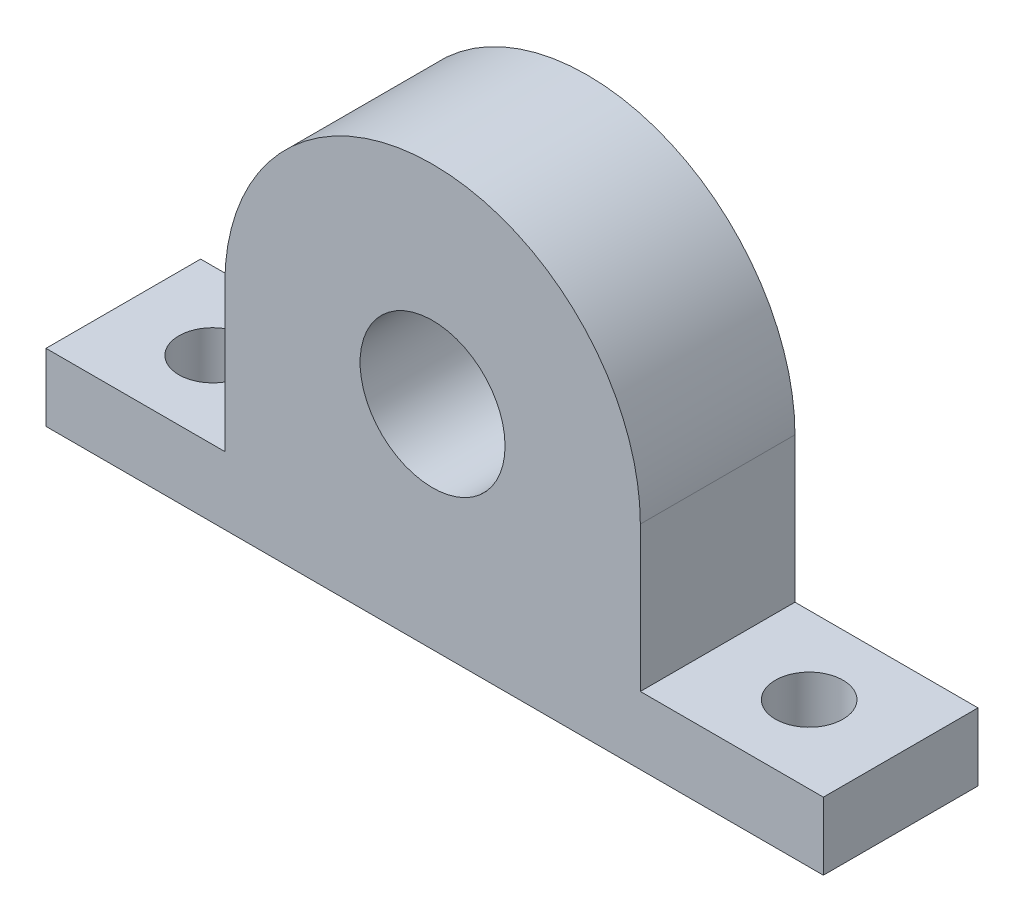
ISO-10303-21;
HEADER;
FILE_DESCRIPTION(('STEP AP214'),'2;1');
FILE_NAME('part.step','',(''),(''),'','','');
FILE_SCHEMA(('AUTOMOTIVE_DESIGN { 1 0 10303 214 1 1 1 1 }'));
ENDSEC;
DATA;
#1=APPLICATION_CONTEXT('core data for automotive mechanical design processes');
#2=APPLICATION_PROTOCOL_DEFINITION('international standard','automotive_design',2000,#1);
#3=PRODUCT_CONTEXT('',#1,'mechanical');
#4=PRODUCT('Part','Part','',(#3));
#5=PRODUCT_RELATED_PRODUCT_CATEGORY('part','',(#4));
#6=PRODUCT_DEFINITION_FORMATION('','',#4);
#7=PRODUCT_DEFINITION_CONTEXT('part definition',#1,'design');
#8=PRODUCT_DEFINITION('design','',#6,#7);
#9=PRODUCT_DEFINITION_SHAPE('','',#8);
#10=(LENGTH_UNIT() NAMED_UNIT(*) SI_UNIT(.MILLI.,.METRE.));
#11=(NAMED_UNIT(*) PLANE_ANGLE_UNIT() SI_UNIT($,.RADIAN.));
#12=(NAMED_UNIT(*) SI_UNIT($,.STERADIAN.) SOLID_ANGLE_UNIT());
#13=UNCERTAINTY_MEASURE_WITH_UNIT(LENGTH_MEASURE(1.E-05),#10,'distance_accuracy_value','');
#14=(GEOMETRIC_REPRESENTATION_CONTEXT(3) GLOBAL_UNCERTAINTY_ASSIGNED_CONTEXT((#13)) GLOBAL_UNIT_ASSIGNED_CONTEXT((#10,
#11,#12)) REPRESENTATION_CONTEXT('',''));
#15=CARTESIAN_POINT('',(0.,0.,0.));
#16=DIRECTION('',(0.,0.,1.));
#17=DIRECTION('',(1.,0.,0.));
#18=AXIS2_PLACEMENT_3D('',#15,#16,#17);
#19=CARTESIAN_POINT('',(21.5,0.,16.));
#20=DIRECTION('',(1.,0.,0.));
#21=DIRECTION('',(0.,0.,-1.));
#22=AXIS2_PLACEMENT_3D('',#19,#20,#21);
#23=PLANE('',#22);
#24=DIRECTION('',(0.,-1.,0.));
#25=VECTOR('',#24,1.);
#26=CARTESIAN_POINT('',(21.5,0.,0.));
#27=LINE('',#26,#25);
#28=CARTESIAN_POINT('',(21.5,0.,0.));
#29=VERTEX_POINT('',#28);
#30=CARTESIAN_POINT('',(21.5,-15.,0.));
#31=VERTEX_POINT('',#30);
#32=EDGE_CURVE('E147',#29,#31,#27,.T.);
#33=ORIENTED_EDGE('',*,*,#32,.F.);
#34=DIRECTION('',(0.,0.,-1.));
#35=VECTOR('',#34,1.);
#36=CARTESIAN_POINT('',(21.5,0.,16.));
#37=LINE('',#36,#35);
#38=CARTESIAN_POINT('',(21.5,0.,16.));
#39=VERTEX_POINT('',#38);
#40=EDGE_CURVE('E11',#39,#29,#37,.T.);
#41=ORIENTED_EDGE('',*,*,#40,.F.);
#42=DIRECTION('',(0.,-1.,0.));
#43=VECTOR('',#42,1.);
#44=CARTESIAN_POINT('',(21.5,0.,16.));
#45=LINE('',#44,#43);
#46=CARTESIAN_POINT('',(21.5,-15.,16.));
#47=VERTEX_POINT('',#46);
#48=EDGE_CURVE('E175',#39,#47,#45,.T.);
#49=ORIENTED_EDGE('',*,*,#48,.T.);
#50=DIRECTION('',(0.,0.,-1.));
#51=VECTOR('',#50,1.);
#52=CARTESIAN_POINT('',(21.5,-15.,16.));
#53=LINE('',#52,#51);
#54=EDGE_CURVE('E59',#47,#31,#53,.T.);
#55=ORIENTED_EDGE('',*,*,#54,.T.);
#56=EDGE_LOOP('',(#33,#41,#49,#55));
#57=FACE_BOUND('',#56,.T.);
#58=ADVANCED_FACE('F41',(#57),#23,.T.);
#59=CARTESIAN_POINT('',(0.,0.,16.));
#60=DIRECTION('',(0.,0.,-1.));
#61=DIRECTION('',(-1.,0.,0.));
#62=AXIS2_PLACEMENT_3D('',#59,#60,#61);
#63=CYLINDRICAL_SURFACE('',#62,21.5);
#64=CARTESIAN_POINT('',(0.,0.,0.));
#65=DIRECTION('',(0.,0.,1.));
#66=DIRECTION('',(1.,0.,0.));
#67=AXIS2_PLACEMENT_3D('',#64,#65,#66);
#68=CIRCLE('',#67,21.5);
#69=CARTESIAN_POINT('',(-21.5,0.,0.));
#70=VERTEX_POINT('',#69);
#71=EDGE_CURVE('E150',#29,#70,#68,.T.);
#72=ORIENTED_EDGE('',*,*,#71,.T.);
#73=DIRECTION('',(0.,0.,-1.));
#74=VECTOR('',#73,1.);
#75=CARTESIAN_POINT('',(-21.5,0.,16.));
#76=LINE('',#75,#74);
#77=CARTESIAN_POINT('',(-21.5,0.,16.));
#78=VERTEX_POINT('',#77);
#79=EDGE_CURVE('E51',#78,#70,#76,.T.);
#80=ORIENTED_EDGE('',*,*,#79,.F.);
#81=CARTESIAN_POINT('',(0.,0.,16.));
#82=DIRECTION('',(0.,0.,1.));
#83=DIRECTION('',(1.,0.,0.));
#84=AXIS2_PLACEMENT_3D('',#81,#82,#83);
#85=CIRCLE('',#84,21.5);
#86=EDGE_CURVE('E209',#39,#78,#85,.T.);
#87=ORIENTED_EDGE('',*,*,#86,.F.);
#88=ORIENTED_EDGE('',*,*,#40,.T.);
#89=EDGE_LOOP('',(#72,#80,#87,#88));
#90=FACE_BOUND('',#89,.T.);
#91=ADVANCED_FACE('F242',(#90),#63,.T.);
#92=CARTESIAN_POINT('',(-21.5,0.,16.));
#93=DIRECTION('',(1.,0.,0.));
#94=DIRECTION('',(0.,0.,-1.));
#95=AXIS2_PLACEMENT_3D('',#92,#93,#94);
#96=PLANE('',#95);
#97=DIRECTION('',(0.,-1.,0.));
#98=VECTOR('',#97,1.);
#99=CARTESIAN_POINT('',(-21.5,0.,0.));
#100=LINE('',#99,#98);
#101=CARTESIAN_POINT('',(-21.5,-15.,0.));
#102=VERTEX_POINT('',#101);
#103=EDGE_CURVE('E153',#70,#102,#100,.T.);
#104=ORIENTED_EDGE('',*,*,#103,.T.);
#105=DIRECTION('',(0.,0.,-1.));
#106=VECTOR('',#105,1.);
#107=CARTESIAN_POINT('',(-21.5,-15.,16.));
#108=LINE('',#107,#106);
#109=CARTESIAN_POINT('',(-21.5,-15.,16.));
#110=VERTEX_POINT('',#109);
#111=EDGE_CURVE('E185',#110,#102,#108,.T.);
#112=ORIENTED_EDGE('',*,*,#111,.F.);
#113=DIRECTION('',(0.,-1.,0.));
#114=VECTOR('',#113,1.);
#115=CARTESIAN_POINT('',(-21.5,0.,16.));
#116=LINE('',#115,#114);
#117=EDGE_CURVE('E196',#78,#110,#116,.T.);
#118=ORIENTED_EDGE('',*,*,#117,.F.);
#119=ORIENTED_EDGE('',*,*,#79,.T.);
#120=EDGE_LOOP('',(#104,#112,#118,#119));
#121=FACE_BOUND('',#120,.T.);
#122=ADVANCED_FACE('F194',(#121),#96,.F.);
#123=CARTESIAN_POINT('',(0.,-15.,16.));
#124=DIRECTION('',(0.,1.,0.));
#125=DIRECTION('',(0.,0.,1.));
#126=AXIS2_PLACEMENT_3D('',#123,#124,#125);
#127=PLANE('',#126);
#128=CARTESIAN_POINT('',(-30.75,-15.,8.));
#129=DIRECTION('',(0.,1.,0.));
#130=DIRECTION('',(0.,0.,1.));
#131=AXIS2_PLACEMENT_3D('',#128,#129,#130);
#132=CIRCLE('',#131,3.5);
#133=CARTESIAN_POINT('',(-30.75,-15.,11.5));
#134=VERTEX_POINT('',#133);
#135=EDGE_CURVE('E222',#134,#134,#132,.T.);
#136=ORIENTED_EDGE('',*,*,#135,.F.);
#137=EDGE_LOOP('',(#136));
#138=FACE_BOUND('',#137,.T.);
#139=DIRECTION('',(1.,0.,0.));
#140=VECTOR('',#139,1.);
#141=CARTESIAN_POINT('',(0.,-15.,0.));
#142=LINE('',#141,#140);
#143=CARTESIAN_POINT('',(-40.,-15.,0.));
#144=VERTEX_POINT('',#143);
#145=EDGE_CURVE('E157',#144,#102,#142,.T.);
#146=ORIENTED_EDGE('',*,*,#145,.F.);
#147=DIRECTION('',(0.,0.,-1.));
#148=VECTOR('',#147,1.);
#149=CARTESIAN_POINT('',(-40.,-15.,16.));
#150=LINE('',#149,#148);
#151=CARTESIAN_POINT('',(-40.,-15.,16.));
#152=VERTEX_POINT('',#151);
#153=EDGE_CURVE('E182',#152,#144,#150,.T.);
#154=ORIENTED_EDGE('',*,*,#153,.F.);
#155=DIRECTION('',(1.,0.,0.));
#156=VECTOR('',#155,1.);
#157=CARTESIAN_POINT('',(0.,-15.,16.));
#158=LINE('',#157,#156);
#159=EDGE_CURVE('E139',#152,#110,#158,.T.);
#160=ORIENTED_EDGE('',*,*,#159,.T.);
#161=ORIENTED_EDGE('',*,*,#111,.T.);
#162=EDGE_LOOP('',(#146,#154,#160,#161));
#163=FACE_BOUND('',#162,.T.);
#164=ADVANCED_FACE('F205',(#138,#163),#127,.T.);
#165=CARTESIAN_POINT('',(-40.,0.,16.));
#166=DIRECTION('',(-1.,0.,0.));
#167=DIRECTION('',(0.,0.,1.));
#168=AXIS2_PLACEMENT_3D('',#165,#166,#167);
#169=PLANE('',#168);
#170=DIRECTION('',(0.,1.,0.));
#171=VECTOR('',#170,1.);
#172=CARTESIAN_POINT('',(-40.,0.,0.));
#173=LINE('',#172,#171);
#174=CARTESIAN_POINT('',(-40.,-22.,0.));
#175=VERTEX_POINT('',#174);
#176=EDGE_CURVE('E161',#175,#144,#173,.T.);
#177=ORIENTED_EDGE('',*,*,#176,.F.);
#178=DIRECTION('',(0.,0.,-1.));
#179=VECTOR('',#178,1.);
#180=CARTESIAN_POINT('',(-40.,-22.,16.));
#181=LINE('',#180,#179);
#182=CARTESIAN_POINT('',(-40.,-22.,16.));
#183=VERTEX_POINT('',#182);
#184=EDGE_CURVE('E120',#183,#175,#181,.T.);
#185=ORIENTED_EDGE('',*,*,#184,.F.);
#186=DIRECTION('',(0.,1.,0.));
#187=VECTOR('',#186,1.);
#188=CARTESIAN_POINT('',(-40.,0.,16.));
#189=LINE('',#188,#187);
#190=EDGE_CURVE('E135',#183,#152,#189,.T.);
#191=ORIENTED_EDGE('',*,*,#190,.T.);
#192=ORIENTED_EDGE('',*,*,#153,.T.);
#193=EDGE_LOOP('',(#177,#185,#191,#192));
#194=FACE_BOUND('',#193,.T.);
#195=ADVANCED_FACE('F234',(#194),#169,.T.);
#196=CARTESIAN_POINT('',(0.,-22.,16.));
#197=DIRECTION('',(0.,-1.,0.));
#198=DIRECTION('',(0.,0.,-1.));
#199=AXIS2_PLACEMENT_3D('',#196,#197,#198);
#200=PLANE('',#199);
#201=CARTESIAN_POINT('',(-30.75,-22.,8.));
#202=DIRECTION('',(0.,-1.,0.));
#203=DIRECTION('',(0.,0.,-1.));
#204=AXIS2_PLACEMENT_3D('',#201,#202,#203);
#205=CIRCLE('',#204,3.5);
#206=CARTESIAN_POINT('',(-30.75,-22.,4.5));
#207=VERTEX_POINT('',#206);
#208=EDGE_CURVE('E44',#207,#207,#205,.T.);
#209=ORIENTED_EDGE('',*,*,#208,.F.);
#210=EDGE_LOOP('',(#209));
#211=FACE_BOUND('',#210,.T.);
#212=CARTESIAN_POINT('',(30.9699700372951,-22.,8.));
#213=DIRECTION('',(0.,-1.,0.));
#214=DIRECTION('',(0.,0.,-1.));
#215=AXIS2_PLACEMENT_3D('',#212,#213,#214);
#216=CIRCLE('',#215,3.5);
#217=CARTESIAN_POINT('',(30.9699700372951,-22.,4.5));
#218=VERTEX_POINT('',#217);
#219=EDGE_CURVE('E218',#218,#218,#216,.T.);
#220=ORIENTED_EDGE('',*,*,#219,.F.);
#221=EDGE_LOOP('',(#220));
#222=FACE_BOUND('',#221,.T.);
#223=DIRECTION('',(-1.,0.,0.));
#224=VECTOR('',#223,1.);
#225=CARTESIAN_POINT('',(0.,-22.,0.));
#226=LINE('',#225,#224);
#227=CARTESIAN_POINT('',(40.4399400745901,-22.,0.));
#228=VERTEX_POINT('',#227);
#229=EDGE_CURVE('E116',#228,#175,#226,.T.);
#230=ORIENTED_EDGE('',*,*,#229,.F.);
#231=DIRECTION('',(0.,0.,-1.));
#232=VECTOR('',#231,1.);
#233=CARTESIAN_POINT('',(40.4399400745901,-22.,16.));
#234=LINE('',#233,#232);
#235=CARTESIAN_POINT('',(40.4399400745901,-22.,16.));
#236=VERTEX_POINT('',#235);
#237=EDGE_CURVE('E110',#236,#228,#234,.T.);
#238=ORIENTED_EDGE('',*,*,#237,.F.);
#239=DIRECTION('',(-1.,0.,0.));
#240=VECTOR('',#239,1.);
#241=CARTESIAN_POINT('',(0.,-22.,16.));
#242=LINE('',#241,#240);
#243=EDGE_CURVE('E114',#236,#183,#242,.T.);
#244=ORIENTED_EDGE('',*,*,#243,.T.);
#245=ORIENTED_EDGE('',*,*,#184,.T.);
#246=EDGE_LOOP('',(#230,#238,#244,#245));
#247=FACE_BOUND('',#246,.T.);
#248=ADVANCED_FACE('F112',(#211,#222,#247),#200,.T.);
#249=CARTESIAN_POINT('',(40.4399400745901,0.,16.));
#250=DIRECTION('',(-1.,0.,0.));
#251=DIRECTION('',(0.,-1.,0.));
#252=AXIS2_PLACEMENT_3D('',#249,#250,#251);
#253=PLANE('',#252);
#254=DIRECTION('',(0.,1.,0.));
#255=VECTOR('',#254,1.);
#256=CARTESIAN_POINT('',(40.4399400745901,0.,0.));
#257=LINE('',#256,#255);
#258=CARTESIAN_POINT('',(40.4399400745901,-15.,0.));
#259=VERTEX_POINT('',#258);
#260=EDGE_CURVE('E168',#228,#259,#257,.T.);
#261=ORIENTED_EDGE('',*,*,#260,.T.);
#262=DIRECTION('',(0.,0.,-1.));
#263=VECTOR('',#262,1.);
#264=CARTESIAN_POINT('',(40.4399400745901,-15.,16.));
#265=LINE('',#264,#263);
#266=CARTESIAN_POINT('',(40.4399400745901,-15.,16.));
#267=VERTEX_POINT('',#266);
#268=EDGE_CURVE('E85',#267,#259,#265,.T.);
#269=ORIENTED_EDGE('',*,*,#268,.F.);
#270=DIRECTION('',(0.,1.,0.));
#271=VECTOR('',#270,1.);
#272=CARTESIAN_POINT('',(40.4399400745901,0.,16.));
#273=LINE('',#272,#271);
#274=EDGE_CURVE('E122',#236,#267,#273,.T.);
#275=ORIENTED_EDGE('',*,*,#274,.F.);
#276=ORIENTED_EDGE('',*,*,#237,.T.);
#277=EDGE_LOOP('',(#261,#269,#275,#276));
#278=FACE_BOUND('',#277,.T.);
#279=ADVANCED_FACE('F123',(#278),#253,.F.);
#280=CARTESIAN_POINT('',(30.9699700372951,-15.,8.));
#281=DIRECTION('',(0.,1.,0.));
#282=DIRECTION('',(0.,0.,1.));
#283=AXIS2_PLACEMENT_3D('',#280,#281,#282);
#284=CIRCLE('',#283,3.5);
#285=CARTESIAN_POINT('',(30.9699700372951,-15.,11.5));
#286=VERTEX_POINT('',#285);
#287=EDGE_CURVE('E223',#286,#286,#284,.T.);
#288=ORIENTED_EDGE('',*,*,#287,.F.);
#289=EDGE_LOOP('',(#288));
#290=FACE_BOUND('',#289,.T.);
#291=EDGE_CURVE('E162',#31,#259,#142,.T.);
#292=ORIENTED_EDGE('',*,*,#291,.F.);
#293=ORIENTED_EDGE('',*,*,#54,.F.);
#294=EDGE_CURVE('E127',#47,#267,#158,.T.);
#295=ORIENTED_EDGE('',*,*,#294,.T.);
#296=ORIENTED_EDGE('',*,*,#268,.T.);
#297=EDGE_LOOP('',(#292,#293,#295,#296));
#298=FACE_BOUND('',#297,.T.);
#299=ADVANCED_FACE('F212',(#290,#298),#127,.T.);
#300=CARTESIAN_POINT('',(0.,0.,16.));
#301=DIRECTION('',(0.,0.,-1.));
#302=DIRECTION('',(-1.,0.,0.));
#303=AXIS2_PLACEMENT_3D('',#300,#301,#302);
#304=CYLINDRICAL_SURFACE('',#303,7.5);
#305=CARTESIAN_POINT('',(0.,0.,16.));
#306=DIRECTION('',(0.,0.,1.));
#307=DIRECTION('',(1.,0.,0.));
#308=AXIS2_PLACEMENT_3D('',#305,#306,#307);
#309=CIRCLE('',#308,7.5);
#310=CARTESIAN_POINT('',(7.5,0.,16.));
#311=VERTEX_POINT('',#310);
#312=EDGE_CURVE('E143',#311,#311,#309,.T.);
#313=ORIENTED_EDGE('',*,*,#312,.T.);
#314=EDGE_LOOP('',(#313));
#315=FACE_BOUND('',#314,.T.);
#316=CARTESIAN_POINT('',(0.,0.,0.));
#317=DIRECTION('',(0.,0.,1.));
#318=DIRECTION('',(1.,0.,0.));
#319=AXIS2_PLACEMENT_3D('',#316,#317,#318);
#320=CIRCLE('',#319,7.5);
#321=CARTESIAN_POINT('',(7.5,0.,0.));
#322=VERTEX_POINT('',#321);
#323=EDGE_CURVE('E171',#322,#322,#320,.T.);
#324=ORIENTED_EDGE('',*,*,#323,.F.);
#325=EDGE_LOOP('',(#324));
#326=FACE_BOUND('',#325,.T.);
#327=ADVANCED_FACE('F247',(#315,#326),#304,.F.);
#328=CARTESIAN_POINT('',(0.,0.,16.));
#329=DIRECTION('',(0.,0.,1.));
#330=DIRECTION('',(1.,0.,0.));
#331=AXIS2_PLACEMENT_3D('',#328,#329,#330);
#332=PLANE('',#331);
#333=ORIENTED_EDGE('',*,*,#48,.F.);
#334=ORIENTED_EDGE('',*,*,#86,.T.);
#335=ORIENTED_EDGE('',*,*,#117,.T.);
#336=ORIENTED_EDGE('',*,*,#159,.F.);
#337=ORIENTED_EDGE('',*,*,#190,.F.);
#338=ORIENTED_EDGE('',*,*,#243,.F.);
#339=ORIENTED_EDGE('',*,*,#274,.T.);
#340=ORIENTED_EDGE('',*,*,#294,.F.);
#341=EDGE_LOOP('',(#333,#334,#335,#336,#337,#338,#339,#340));
#342=FACE_BOUND('',#341,.T.);
#343=ORIENTED_EDGE('',*,*,#312,.F.);
#344=EDGE_LOOP('',(#343));
#345=FACE_BOUND('',#344,.T.);
#346=ADVANCED_FACE('F131',(#342,#345),#332,.T.);
#347=CARTESIAN_POINT('',(0.,0.,0.));
#348=DIRECTION('',(0.,0.,1.));
#349=DIRECTION('',(1.,0.,0.));
#350=AXIS2_PLACEMENT_3D('',#347,#348,#349);
#351=PLANE('',#350);
#352=ORIENTED_EDGE('',*,*,#32,.T.);
#353=ORIENTED_EDGE('',*,*,#291,.T.);
#354=ORIENTED_EDGE('',*,*,#260,.F.);
#355=ORIENTED_EDGE('',*,*,#229,.T.);
#356=ORIENTED_EDGE('',*,*,#176,.T.);
#357=ORIENTED_EDGE('',*,*,#145,.T.);
#358=ORIENTED_EDGE('',*,*,#103,.F.);
#359=ORIENTED_EDGE('',*,*,#71,.F.);
#360=EDGE_LOOP('',(#352,#353,#354,#355,#356,#357,#358,#359));
#361=FACE_BOUND('',#360,.T.);
#362=ORIENTED_EDGE('',*,*,#323,.T.);
#363=EDGE_LOOP('',(#362));
#364=FACE_BOUND('',#363,.T.);
#365=ADVANCED_FACE('F200',(#361,#364),#351,.F.);
#366=CARTESIAN_POINT('',(30.9699700372951,-31.,8.));
#367=DIRECTION('',(0.,1.,0.));
#368=DIRECTION('',(0.,0.,1.));
#369=AXIS2_PLACEMENT_3D('',#366,#367,#368);
#370=CYLINDRICAL_SURFACE('',#369,3.5);
#371=ORIENTED_EDGE('',*,*,#219,.T.);
#372=EDGE_LOOP('',(#371));
#373=FACE_BOUND('',#372,.T.);
#374=ORIENTED_EDGE('',*,*,#287,.T.);
#375=EDGE_LOOP('',(#374));
#376=FACE_BOUND('',#375,.T.);
#377=ADVANCED_FACE('F265',(#373,#376),#370,.F.);
#378=CARTESIAN_POINT('',(-30.75,-31.,8.));
#379=DIRECTION('',(0.,1.,0.));
#380=DIRECTION('',(0.,0.,1.));
#381=AXIS2_PLACEMENT_3D('',#378,#379,#380);
#382=CYLINDRICAL_SURFACE('',#381,3.5);
#383=ORIENTED_EDGE('',*,*,#208,.T.);
#384=EDGE_LOOP('',(#383));
#385=FACE_BOUND('',#384,.T.);
#386=ORIENTED_EDGE('',*,*,#135,.T.);
#387=EDGE_LOOP('',(#386));
#388=FACE_BOUND('',#387,.T.);
#389=ADVANCED_FACE('F231',(#385,#388),#382,.F.);
#390=CLOSED_SHELL('',(#58,#91,#122,#164,#195,#248,#279,#299,#327,#346,#365,#377,#389));
#391=MANIFOLD_SOLID_BREP('B2',#390);
#392=ADVANCED_BREP_SHAPE_REPRESENTATION('',(#18,#391),#14);
#393=SHAPE_DEFINITION_REPRESENTATION(#9,#392);
ENDSEC;
END-ISO-10303-21;
